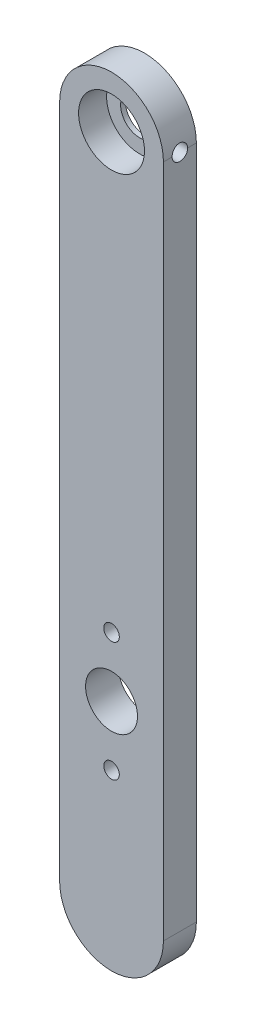
ISO-10303-21;
HEADER;
FILE_DESCRIPTION(('STEP AP214'),'2;1');
FILE_NAME('part.step','',(''),(''),'','','');
FILE_SCHEMA(('AUTOMOTIVE_DESIGN { 1 0 10303 214 1 1 1 1 }'));
ENDSEC;
DATA;
#1=APPLICATION_CONTEXT('core data for automotive mechanical design processes');
#2=APPLICATION_PROTOCOL_DEFINITION('international standard','automotive_design',2000,#1);
#3=PRODUCT_CONTEXT('',#1,'mechanical');
#4=PRODUCT('Part','Part','',(#3));
#5=PRODUCT_RELATED_PRODUCT_CATEGORY('part','',(#4));
#6=PRODUCT_DEFINITION_FORMATION('','',#4);
#7=PRODUCT_DEFINITION_CONTEXT('part definition',#1,'design');
#8=PRODUCT_DEFINITION('design','',#6,#7);
#9=PRODUCT_DEFINITION_SHAPE('','',#8);
#10=(LENGTH_UNIT() NAMED_UNIT(*) SI_UNIT(.MILLI.,.METRE.));
#11=(NAMED_UNIT(*) PLANE_ANGLE_UNIT() SI_UNIT($,.RADIAN.));
#12=(NAMED_UNIT(*) SI_UNIT($,.STERADIAN.) SOLID_ANGLE_UNIT());
#13=UNCERTAINTY_MEASURE_WITH_UNIT(LENGTH_MEASURE(1.E-05),#10,'distance_accuracy_value','');
#14=(GEOMETRIC_REPRESENTATION_CONTEXT(3) GLOBAL_UNCERTAINTY_ASSIGNED_CONTEXT((#13)) GLOBAL_UNIT_ASSIGNED_CONTEXT((#10,
#11,#12)) REPRESENTATION_CONTEXT('',''));
#15=CARTESIAN_POINT('',(0.,0.,0.));
#16=DIRECTION('',(0.,0.,1.));
#17=DIRECTION('',(1.,0.,0.));
#18=AXIS2_PLACEMENT_3D('',#15,#16,#17);
#19=CARTESIAN_POINT('',(0.,65.,6.35));
#20=DIRECTION('',(0.,0.,-1.));
#21=DIRECTION('',(-1.,0.,0.));
#22=AXIS2_PLACEMENT_3D('',#19,#20,#21);
#23=CYLINDRICAL_SURFACE('',#22,10.);
#24=DIRECTION('',(0.,0.,-1.));
#25=VECTOR('',#24,1.);
#26=CARTESIAN_POINT('',(10.,65.,6.35));
#27=LINE('',#26,#25);
#28=CARTESIAN_POINT('',(10.,65.,6.35));
#29=VERTEX_POINT('',#28);
#30=CARTESIAN_POINT('',(10.,65.,4.675));
#31=VERTEX_POINT('',#30);
#32=EDGE_CURVE('E103',#29,#31,#27,.T.);
#33=ORIENTED_EDGE('',*,*,#32,.T.);
#34=CARTESIAN_POINT('',(10.,65.,4.675));
#35=CARTESIAN_POINT('',(10.0000014685064,65.0419508736504,4.67499999537497));
#36=CARTESIAN_POINT('',(9.99973568704626,65.0838814247861,4.67323901308362));
#37=CARTESIAN_POINT('',(9.99868521479133,65.1674379610659,4.66621554686748));
#38=CARTESIAN_POINT('',(9.99790056985298,65.209063972796,4.66095337237313));
#39=CARTESIAN_POINT('',(9.99479588619008,65.3329314886251,4.63997389798776));
#40=CARTESIAN_POINT('',(9.99172497314488,65.414336104094,4.61906345213102));
#41=CARTESIAN_POINT('',(9.98391758917327,65.5724284238681,4.56400833880989));
#42=CARTESIAN_POINT('',(9.97918066213689,65.6491148296921,4.5298600469162));
#43=CARTESIAN_POINT('',(9.96856534959666,65.795678956542,4.44931680441856));
#44=CARTESIAN_POINT('',(9.96268699957249,65.8655568890993,4.40292223445846));
#45=CARTESIAN_POINT('',(9.95039202655103,65.9970445259113,4.29882526877398));
#46=CARTESIAN_POINT('',(9.94397197786064,66.0585940245488,4.24104725672947));
#47=CARTESIAN_POINT('',(9.93134322340571,66.1711695622192,4.11597898804128));
#48=CARTESIAN_POINT('',(9.92513455081534,66.2221939557012,4.04868724673825));
#49=CARTESIAN_POINT('',(9.91359860664949,66.3124986952271,3.90609726537435));
#50=CARTESIAN_POINT('',(9.90827581009234,66.3517201783025,3.83076135392112));
#51=CARTESIAN_POINT('',(9.89916189093435,66.4169278188574,3.67448245934922));
#52=CARTESIAN_POINT('',(9.895370595862,66.4429154667638,3.59354010880838));
#53=CARTESIAN_POINT('',(9.88978259593446,66.4807317658851,3.42898294683243));
#54=CARTESIAN_POINT('',(9.887971200635,66.4926647518175,3.34539262016965));
#55=CARTESIAN_POINT('',(9.88650348181946,66.502356291557,3.177375865936));
#56=CARTESIAN_POINT('',(9.88684708626086,66.5001153192052,3.09294946640958));
#57=CARTESIAN_POINT('',(9.88963718763457,66.4816073070065,2.92639867029686));
#58=CARTESIAN_POINT('',(9.89206620232456,66.4654568683382,2.84426098127216));
#59=CARTESIAN_POINT('',(9.8987261063924,66.4197709914713,2.68387516321023));
#60=CARTESIAN_POINT('',(9.90295703599485,66.3902352544683,2.60562712104614));
#61=CARTESIAN_POINT('',(9.9127634526375,66.3184953494658,2.45488514064789));
#62=CARTESIAN_POINT('',(9.91834418902924,66.2762415606179,2.38241517319383));
#63=CARTESIAN_POINT('',(9.9302173239709,66.1803019201499,2.2455528505844));
#64=CARTESIAN_POINT('',(9.93650974119489,66.1266157685189,2.18116070747983));
#65=CARTESIAN_POINT('',(9.94917383032147,66.008703665483,2.06161087632562));
#66=CARTESIAN_POINT('',(9.95554567106682,65.9443788291936,2.0065507016511));
#67=CARTESIAN_POINT('',(9.96759485035054,65.8073265565302,1.90797639950774));
#68=CARTESIAN_POINT('',(9.97327198853176,65.7345967077954,1.86446559874978));
#69=CARTESIAN_POINT('',(9.98329879009978,65.5827046110578,1.79022045732164));
#70=CARTESIAN_POINT('',(9.98764689268089,65.5035349372274,1.75950112360304));
#71=CARTESIAN_POINT('',(9.99450841265944,65.3411362683109,1.71186541412821));
#72=CARTESIAN_POINT('',(9.99702457329285,65.257913542677,1.69492839559143));
#73=CARTESIAN_POINT('',(9.99899011948561,65.1450605368035,1.68174566903024));
#74=CARTESIAN_POINT('',(9.99936853868559,65.1160817227372,1.679214915476));
#75=CARTESIAN_POINT('',(9.9998732025813,65.0580727726574,1.67584431341621));
#76=CARTESIAN_POINT('',(9.99999987181747,65.029042805815,1.67500161822181));
#77=CARTESIAN_POINT('',(10.,65.,1.675));
#78=B_SPLINE_CURVE_WITH_KNOTS('',3,(#34,#35,#36,#37,#38,#39,#40,#41,#42,#43,#44,#45,#46,#47,#48,
#49,#50,#51,#52,#53,#54,#55,#56,#57,#58,#59,#60,#61,#62,#63,#64,#65,#66,#67,#68,#69,#70,#71,#72,
#73,#74,#75,#76,#77),.UNSPECIFIED.,.F.,.F.,(4,2,2,2,2,2,2,2,2,2,2,2,2,2,2,2,2,2,2,2,2,4),(0.,
0.125774596002484,0.251538077699336,0.502550836025,0.753632368476194,1.00470609762704,
1.25750755614574,1.51034850908069,1.7644302832657,2.01848343580798,2.27063849496753,
2.52278512452481,2.7728383913245,3.02289724042136,3.27394465404091,3.52499865652247,
3.77853286607111,4.03214002520141,4.28604388366316,4.53956674814968,4.62680426579006,
4.71389454454005),.UNSPECIFIED.);
#79=CARTESIAN_POINT('',(10.,65.,1.675));
#80=VERTEX_POINT('',#79);
#81=EDGE_CURVE('E58',#31,#80,#78,.T.);
#82=ORIENTED_EDGE('',*,*,#81,.T.);
#83=CARTESIAN_POINT('',(10.,65.,0.));
#84=VERTEX_POINT('',#83);
#85=EDGE_CURVE('E88',#80,#84,#27,.T.);
#86=ORIENTED_EDGE('',*,*,#85,.T.);
#87=CARTESIAN_POINT('',(0.,65.,0.));
#88=DIRECTION('',(0.,0.,1.));
#89=DIRECTION('',(1.,0.,0.));
#90=AXIS2_PLACEMENT_3D('',#87,#88,#89);
#91=CIRCLE('',#90,10.);
#92=CARTESIAN_POINT('',(-10.,65.,0.));
#93=VERTEX_POINT('',#92);
#94=EDGE_CURVE('E140',#84,#93,#91,.T.);
#95=ORIENTED_EDGE('',*,*,#94,.T.);
#96=DIRECTION('',(0.,0.,-1.));
#97=VECTOR('',#96,1.);
#98=CARTESIAN_POINT('',(-10.,65.,6.35));
#99=LINE('',#98,#97);
#100=CARTESIAN_POINT('',(-10.,65.,6.35));
#101=VERTEX_POINT('',#100);
#102=EDGE_CURVE('E11',#101,#93,#99,.T.);
#103=ORIENTED_EDGE('',*,*,#102,.F.);
#104=CARTESIAN_POINT('',(0.,65.,6.35));
#105=DIRECTION('',(0.,0.,1.));
#106=DIRECTION('',(1.,0.,0.));
#107=AXIS2_PLACEMENT_3D('',#104,#105,#106);
#108=CIRCLE('',#107,10.);
#109=EDGE_CURVE('E142',#29,#101,#108,.T.);
#110=ORIENTED_EDGE('',*,*,#109,.F.);
#111=EDGE_LOOP('',(#33,#82,#86,#95,#103,#110));
#112=FACE_BOUND('',#111,.T.);
#113=ADVANCED_FACE('F37',(#112),#23,.T.);
#114=CARTESIAN_POINT('',(-10.,65.,6.35));
#115=DIRECTION('',(1.,0.,0.));
#116=DIRECTION('',(0.,0.,-1.));
#117=AXIS2_PLACEMENT_3D('',#114,#115,#116);
#118=PLANE('',#117);
#119=DIRECTION('',(0.,-1.,0.));
#120=VECTOR('',#119,1.);
#121=CARTESIAN_POINT('',(-10.,65.,0.));
#122=LINE('',#121,#120);
#123=CARTESIAN_POINT('',(-10.,-65.,0.));
#124=VERTEX_POINT('',#123);
#125=EDGE_CURVE('E147',#93,#124,#122,.T.);
#126=ORIENTED_EDGE('',*,*,#125,.T.);
#127=DIRECTION('',(0.,0.,-1.));
#128=VECTOR('',#127,1.);
#129=CARTESIAN_POINT('',(-10.,-65.,6.35));
#130=LINE('',#129,#128);
#131=CARTESIAN_POINT('',(-10.,-65.,6.35));
#132=VERTEX_POINT('',#131);
#133=EDGE_CURVE('E51',#132,#124,#130,.T.);
#134=ORIENTED_EDGE('',*,*,#133,.F.);
#135=DIRECTION('',(0.,-1.,0.));
#136=VECTOR('',#135,1.);
#137=CARTESIAN_POINT('',(-10.,65.,6.35));
#138=LINE('',#137,#136);
#139=EDGE_CURVE('E95',#101,#132,#138,.T.);
#140=ORIENTED_EDGE('',*,*,#139,.F.);
#141=ORIENTED_EDGE('',*,*,#102,.T.);
#142=EDGE_LOOP('',(#126,#134,#140,#141));
#143=FACE_BOUND('',#142,.T.);
#144=ADVANCED_FACE('F157',(#143),#118,.F.);
#145=CARTESIAN_POINT('',(0.,-65.,6.35));
#146=DIRECTION('',(0.,0.,-1.));
#147=DIRECTION('',(-1.,0.,0.));
#148=AXIS2_PLACEMENT_3D('',#145,#146,#147);
#149=CYLINDRICAL_SURFACE('',#148,10.);
#150=CARTESIAN_POINT('',(0.,-65.,0.));
#151=DIRECTION('',(0.,0.,1.));
#152=DIRECTION('',(1.,0.,0.));
#153=AXIS2_PLACEMENT_3D('',#150,#151,#152);
#154=CIRCLE('',#153,10.);
#155=CARTESIAN_POINT('',(10.,-65.,0.));
#156=VERTEX_POINT('',#155);
#157=EDGE_CURVE('E148',#124,#156,#154,.T.);
#158=ORIENTED_EDGE('',*,*,#157,.T.);
#159=DIRECTION('',(0.,0.,-1.));
#160=VECTOR('',#159,1.);
#161=CARTESIAN_POINT('',(10.,-65.,6.35));
#162=LINE('',#161,#160);
#163=CARTESIAN_POINT('',(10.,-65.,6.35));
#164=VERTEX_POINT('',#163);
#165=EDGE_CURVE('E112',#164,#156,#162,.T.);
#166=ORIENTED_EDGE('',*,*,#165,.F.);
#167=CARTESIAN_POINT('',(0.,-65.,6.35));
#168=DIRECTION('',(0.,0.,1.));
#169=DIRECTION('',(1.,0.,0.));
#170=AXIS2_PLACEMENT_3D('',#167,#168,#169);
#171=CIRCLE('',#170,10.);
#172=EDGE_CURVE('E113',#132,#164,#171,.T.);
#173=ORIENTED_EDGE('',*,*,#172,.F.);
#174=ORIENTED_EDGE('',*,*,#133,.T.);
#175=EDGE_LOOP('',(#158,#166,#173,#174));
#176=FACE_BOUND('',#175,.T.);
#177=ADVANCED_FACE('F152',(#176),#149,.T.);
#178=CARTESIAN_POINT('',(10.,65.,6.35));
#179=DIRECTION('',(-1.,0.,0.));
#180=DIRECTION('',(0.,0.,1.));
#181=AXIS2_PLACEMENT_3D('',#178,#179,#180);
#182=PLANE('',#181);
#183=ORIENTED_EDGE('',*,*,#85,.F.);
#184=CARTESIAN_POINT('',(10.,65.,3.175));
#185=DIRECTION('',(1.,0.,0.));
#186=DIRECTION('',(0.,0.,-1.));
#187=AXIS2_PLACEMENT_3D('',#184,#185,#186);
#188=CIRCLE('',#187,1.5);
#189=EDGE_CURVE('E97',#31,#80,#188,.T.);
#190=ORIENTED_EDGE('',*,*,#189,.F.);
#191=ORIENTED_EDGE('',*,*,#32,.F.);
#192=DIRECTION('',(0.,1.,0.));
#193=VECTOR('',#192,1.);
#194=CARTESIAN_POINT('',(10.,65.,6.35));
#195=LINE('',#194,#193);
#196=EDGE_CURVE('E67',#164,#29,#195,.T.);
#197=ORIENTED_EDGE('',*,*,#196,.F.);
#198=ORIENTED_EDGE('',*,*,#165,.T.);
#199=DIRECTION('',(0.,1.,0.));
#200=VECTOR('',#199,1.);
#201=CARTESIAN_POINT('',(10.,65.,0.));
#202=LINE('',#201,#200);
#203=EDGE_CURVE('E109',#156,#84,#202,.T.);
#204=ORIENTED_EDGE('',*,*,#203,.T.);
#205=EDGE_LOOP('',(#183,#190,#191,#197,#198,#204));
#206=FACE_BOUND('',#205,.T.);
#207=ADVANCED_FACE('F106',(#206),#182,.F.);
#208=CARTESIAN_POINT('',(0.,65.,6.35));
#209=DIRECTION('',(0.,0.,1.));
#210=DIRECTION('',(1.,0.,0.));
#211=AXIS2_PLACEMENT_3D('',#208,#209,#210);
#212=PLANE('',#211);
#213=CARTESIAN_POINT('',(0.,-41.5,6.35));
#214=DIRECTION('',(0.,0.,1.));
#215=DIRECTION('',(1.,0.,0.));
#216=AXIS2_PLACEMENT_3D('',#213,#214,#215);
#217=CIRCLE('',#216,1.5);
#218=CARTESIAN_POINT('',(1.5,-41.5,6.35));
#219=VERTEX_POINT('',#218);
#220=EDGE_CURVE('E104',#219,#219,#217,.T.);
#221=ORIENTED_EDGE('',*,*,#220,.F.);
#222=EDGE_LOOP('',(#221));
#223=FACE_BOUND('',#222,.T.);
#224=CARTESIAN_POINT('',(0.,-18.5,6.35));
#225=DIRECTION('',(0.,0.,1.));
#226=DIRECTION('',(1.,0.,0.));
#227=AXIS2_PLACEMENT_3D('',#224,#225,#226);
#228=CIRCLE('',#227,1.5);
#229=CARTESIAN_POINT('',(1.5,-18.5,6.35));
#230=VERTEX_POINT('',#229);
#231=EDGE_CURVE('E272',#230,#230,#228,.T.);
#232=ORIENTED_EDGE('',*,*,#231,.F.);
#233=EDGE_LOOP('',(#232));
#234=FACE_BOUND('',#233,.T.);
#235=CARTESIAN_POINT('',(0.,-30.,6.35));
#236=DIRECTION('',(0.,0.,1.));
#237=DIRECTION('',(1.,0.,0.));
#238=AXIS2_PLACEMENT_3D('',#235,#236,#237);
#239=CIRCLE('',#238,5.);
#240=CARTESIAN_POINT('',(5.,-30.,6.35));
#241=VERTEX_POINT('',#240);
#242=EDGE_CURVE('E135',#241,#241,#239,.T.);
#243=ORIENTED_EDGE('',*,*,#242,.F.);
#244=EDGE_LOOP('',(#243));
#245=FACE_BOUND('',#244,.T.);
#246=CARTESIAN_POINT('',(0.,65.,6.35));
#247=DIRECTION('',(0.,0.,1.));
#248=DIRECTION('',(1.,0.,0.));
#249=AXIS2_PLACEMENT_3D('',#246,#247,#248);
#250=CIRCLE('',#249,6.35);
#251=CARTESIAN_POINT('',(6.34999999999999,65.,6.35));
#252=VERTEX_POINT('',#251);
#253=EDGE_CURVE('E122',#252,#252,#250,.T.);
#254=ORIENTED_EDGE('',*,*,#253,.F.);
#255=EDGE_LOOP('',(#254));
#256=FACE_BOUND('',#255,.T.);
#257=ORIENTED_EDGE('',*,*,#109,.T.);
#258=ORIENTED_EDGE('',*,*,#139,.T.);
#259=ORIENTED_EDGE('',*,*,#172,.T.);
#260=ORIENTED_EDGE('',*,*,#196,.T.);
#261=EDGE_LOOP('',(#257,#258,#259,#260));
#262=FACE_BOUND('',#261,.T.);
#263=ADVANCED_FACE('F158',(#223,#234,#245,#256,#262),#212,.T.);
#264=CARTESIAN_POINT('',(0.,65.,0.));
#265=DIRECTION('',(0.,0.,1.));
#266=DIRECTION('',(1.,0.,0.));
#267=AXIS2_PLACEMENT_3D('',#264,#265,#266);
#268=PLANE('',#267);
#269=CARTESIAN_POINT('',(0.,-41.5,0.));
#270=DIRECTION('',(0.,0.,1.));
#271=DIRECTION('',(1.,0.,0.));
#272=AXIS2_PLACEMENT_3D('',#269,#270,#271);
#273=CIRCLE('',#272,1.5);
#274=CARTESIAN_POINT('',(1.5,-41.5,0.));
#275=VERTEX_POINT('',#274);
#276=EDGE_CURVE('E275',#275,#275,#273,.T.);
#277=ORIENTED_EDGE('',*,*,#276,.T.);
#278=EDGE_LOOP('',(#277));
#279=FACE_BOUND('',#278,.T.);
#280=CARTESIAN_POINT('',(0.,-18.5,0.));
#281=DIRECTION('',(0.,0.,1.));
#282=DIRECTION('',(1.,0.,0.));
#283=AXIS2_PLACEMENT_3D('',#280,#281,#282);
#284=CIRCLE('',#283,1.5);
#285=CARTESIAN_POINT('',(1.5,-18.5,0.));
#286=VERTEX_POINT('',#285);
#287=EDGE_CURVE('E269',#286,#286,#284,.T.);
#288=ORIENTED_EDGE('',*,*,#287,.T.);
#289=EDGE_LOOP('',(#288));
#290=FACE_BOUND('',#289,.T.);
#291=CARTESIAN_POINT('',(0.,-30.,0.));
#292=DIRECTION('',(0.,0.,1.));
#293=DIRECTION('',(1.,0.,0.));
#294=AXIS2_PLACEMENT_3D('',#291,#292,#293);
#295=CIRCLE('',#294,5.);
#296=CARTESIAN_POINT('',(5.,-30.,0.));
#297=VERTEX_POINT('',#296);
#298=EDGE_CURVE('E130',#297,#297,#295,.T.);
#299=ORIENTED_EDGE('',*,*,#298,.T.);
#300=EDGE_LOOP('',(#299));
#301=FACE_BOUND('',#300,.T.);
#302=CARTESIAN_POINT('',(0.,65.,0.));
#303=DIRECTION('',(0.,0.,1.));
#304=DIRECTION('',(1.,0.,0.));
#305=AXIS2_PLACEMENT_3D('',#302,#303,#304);
#306=CIRCLE('',#305,3.65);
#307=CARTESIAN_POINT('',(3.64999999999999,65.,0.));
#308=VERTEX_POINT('',#307);
#309=EDGE_CURVE('E120',#308,#308,#306,.T.);
#310=ORIENTED_EDGE('',*,*,#309,.T.);
#311=EDGE_LOOP('',(#310));
#312=FACE_BOUND('',#311,.T.);
#313=ORIENTED_EDGE('',*,*,#94,.F.);
#314=ORIENTED_EDGE('',*,*,#203,.F.);
#315=ORIENTED_EDGE('',*,*,#157,.F.);
#316=ORIENTED_EDGE('',*,*,#125,.F.);
#317=EDGE_LOOP('',(#313,#314,#315,#316));
#318=FACE_BOUND('',#317,.T.);
#319=ADVANCED_FACE('F155',(#279,#290,#301,#312,#318),#268,.F.);
#320=CARTESIAN_POINT('',(0.,65.,0.95));
#321=DIRECTION('',(0.,0.,1.));
#322=DIRECTION('',(1.,0.,0.));
#323=AXIS2_PLACEMENT_3D('',#320,#321,#322);
#324=CYLINDRICAL_SURFACE('',#323,6.35);
#325=CARTESIAN_POINT('',(6.34999999999999,65.,1.675));
#326=CARTESIAN_POINT('',(6.34999851724394,65.0830209487421,1.67500257688155));
#327=CARTESIAN_POINT('',(6.34835548464634,65.1660717055425,1.68191570943469));
#328=CARTESIAN_POINT('',(6.34196006203194,65.3298026167738,1.70934998922864));
#329=CARTESIAN_POINT('',(6.3372057005927,65.4104812342622,1.72987976445553));
#330=CARTESIAN_POINT('',(6.32511541536285,65.567078972002,1.78385930734223));
#331=CARTESIAN_POINT('',(6.31778241043487,65.6430033597441,1.8172944710726));
#332=CARTESIAN_POINT('',(6.3013205537597,65.7881641285173,1.89608655368896));
#333=CARTESIAN_POINT('',(6.29219168938456,65.8574004625148,1.94144355640646));
#334=CARTESIAN_POINT('',(6.27294410619426,65.9885041460754,2.04368053942395));
#335=CARTESIAN_POINT('',(6.26281145281054,66.0502298306783,2.10073957298258));
#336=CARTESIAN_POINT('',(6.24279339171245,66.1633300796207,2.22437709118982));
#337=CARTESIAN_POINT('',(6.23290800919792,66.2147035926849,2.2909565414756));
#338=CARTESIAN_POINT('',(6.21436474587977,66.3062885785891,2.43282095444812));
#339=CARTESIAN_POINT('',(6.20572463411778,66.3463450769597,2.50820849776784));
#340=CARTESIAN_POINT('',(6.19085199880807,66.4131635374986,2.66488360121361));
#341=CARTESIAN_POINT('',(6.1846191352844,66.4399273771435,2.74617032626985));
#342=CARTESIAN_POINT('',(6.17540936388889,66.4789243640839,2.91078791256924));
#343=CARTESIAN_POINT('',(6.17237584620283,66.4914104910839,2.99405560628803));
#344=CARTESIAN_POINT('',(6.16973853210433,66.5022850018873,3.16155484676637));
#345=CARTESIAN_POINT('',(6.17013424074104,66.5006754201675,3.24578625267775));
#346=CARTESIAN_POINT('',(6.1742596142321,66.4836068356708,3.41090996101587));
#347=CARTESIAN_POINT('',(6.17791755158492,66.4684457767716,3.4918351294975));
#348=CARTESIAN_POINT('',(6.18804133190496,66.4251784049009,3.64995972740286));
#349=CARTESIAN_POINT('',(6.19450735566557,66.3970712584127,3.72715891658072));
#350=CARTESIAN_POINT('',(6.20958678218058,66.3284467845848,3.87645664379615));
#351=CARTESIAN_POINT('',(6.218219265795,66.2878184115154,3.94850213199463));
#352=CARTESIAN_POINT('',(6.23664776102025,66.1953826164008,4.08486136281564));
#353=CARTESIAN_POINT('',(6.24644395581354,66.1435734333074,4.14917388495947));
#354=CARTESIAN_POINT('',(6.26640074159938,66.0286879051709,4.26995273495692));
#355=CARTESIAN_POINT('',(6.27656427474605,65.9653592290764,4.3261788302287));
#356=CARTESIAN_POINT('',(6.29588562944103,65.8300525364603,4.42725550259074));
#357=CARTESIAN_POINT('',(6.30504342639665,65.7580743085263,4.47210580155035));
#358=CARTESIAN_POINT('',(6.32135942493141,65.6071916141095,4.54923262841604));
#359=CARTESIAN_POINT('',(6.32851195395596,65.5282683124554,4.58147358631544));
#360=CARTESIAN_POINT('',(6.33996993682453,65.3659165605986,4.63216630266991));
#361=CARTESIAN_POINT('',(6.3442758753518,65.2824888799654,4.65062040865422));
#362=CARTESIAN_POINT('',(6.34948503249581,65.1155535389803,4.67285668601183));
#363=CARTESIAN_POINT('',(6.35046421324578,65.0320918238016,4.6769664522477));
#364=CARTESIAN_POINT('',(6.3491242902122,64.8656739204676,4.67129106790021));
#365=CARTESIAN_POINT('',(6.34680544961473,64.7827176925044,4.66150702605959));
#366=CARTESIAN_POINT('',(6.33917838174838,64.6207798301404,4.62859261840112));
#367=CARTESIAN_POINT('',(6.33390950352624,64.5417604890031,4.60563783257741));
#368=CARTESIAN_POINT('',(6.3209740002995,64.3886959136126,4.54723149966576));
#369=CARTESIAN_POINT('',(6.31330714919517,64.3146511492018,4.51177877413378));
#370=CARTESIAN_POINT('',(6.29624149651371,64.172310695681,4.42872644839968));
#371=CARTESIAN_POINT('',(6.28681663475877,64.104127654475,4.38093926429422));
#372=CARTESIAN_POINT('',(6.2673266811016,63.9766314517236,4.27481752950993));
#373=CARTESIAN_POINT('',(6.25726149136241,63.9173196502941,4.21648136451075));
#374=CARTESIAN_POINT('',(6.23735679650374,63.8079241957992,4.08940401687872));
#375=CARTESIAN_POINT('',(6.22752694929492,63.7580690961075,4.02046426640513));
#376=CARTESIAN_POINT('',(6.20945265145425,63.6706397078834,3.87500057804812));
#377=CARTESIAN_POINT('',(6.20120812992859,63.6330648701401,3.79847697953709));
#378=CARTESIAN_POINT('',(6.1873240848113,63.5715336346671,3.64043566793411));
#379=CARTESIAN_POINT('',(6.18166930794985,63.547497298881,3.55895048593829));
#380=CARTESIAN_POINT('',(6.17358371023305,63.5135023808069,3.39294412141734));
#381=CARTESIAN_POINT('',(6.17115227288945,63.5035411065321,3.30842352261579));
#382=CARTESIAN_POINT('',(6.16983199335336,63.4981081090918,3.14106112146151));
#383=CARTESIAN_POINT('',(6.1708541839276,63.5022725122384,3.05823163293271));
#384=CARTESIAN_POINT('',(6.17612233302334,63.5241486824006,2.89449127444565));
#385=CARTESIAN_POINT('',(6.18036823966432,63.5418602313968,2.81358037363241));
#386=CARTESIAN_POINT('',(6.19155859321835,63.5901393302196,2.65632098353121));
#387=CARTESIAN_POINT('',(6.19849016148399,63.620645581895,2.57995269713613));
#388=CARTESIAN_POINT('',(6.21427398682872,63.6935982482732,2.43336716284175));
#389=CARTESIAN_POINT('',(6.2231264810561,63.7360461374252,2.36315067591788));
#390=CARTESIAN_POINT('',(6.24201391004486,63.8328479374515,2.22908721321493));
#391=CARTESIAN_POINT('',(6.25207168946106,63.8874575011935,2.1654280187217));
#392=CARTESIAN_POINT('',(6.27209257501467,64.0065250551108,2.0480583428238));
#393=CARTESIAN_POINT('',(6.2820556584478,64.0709853468298,1.99435019290582));
#394=CARTESIAN_POINT('',(6.30095070373691,64.2091449224679,1.8975916638141));
#395=CARTESIAN_POINT('',(6.30986403352164,64.2829733035021,1.85472173683658));
#396=CARTESIAN_POINT('',(6.32546353967865,64.436988746183,1.78206930320467));
#397=CARTESIAN_POINT('',(6.3321514369973,64.5171708347603,1.752276678042));
#398=CARTESIAN_POINT('',(6.34146337323501,64.6644312976428,1.71145636515545));
#399=CARTESIAN_POINT('',(6.34464362420469,64.7307618976541,1.69781315294047));
#400=CARTESIAN_POINT('',(6.34891247920238,64.8647217864704,1.67958419109222));
#401=CARTESIAN_POINT('',(6.35000120821273,64.9323509974308,1.67499790024723));
#402=CARTESIAN_POINT('',(6.34999999999999,65.,1.675));
#403=B_SPLINE_CURVE_WITH_KNOTS('',3,(#325,#326,#327,#328,#329,#330,#331,#332,#333,#334,#335,
#336,#337,#338,#339,#340,#341,#342,#343,#344,#345,#346,#347,#348,#349,#350,#351,#352,#353,#354,
#355,#356,#357,#358,#359,#360,#361,#362,#363,#364,#365,#366,#367,#368,#369,#370,#371,#372,#373,
#374,#375,#376,#377,#378,#379,#380,#381,#382,#383,#384,#385,#386,#387,#388,#389,#390,#391,#392,
#393,#394,#395,#396,#397,#398,#399,#400,#401,#402),.UNSPECIFIED.,.T.,.F.,(4,2,2,2,2,2,2,2,2,2,2,
2,2,2,2,2,2,2,2,2,2,2,2,2,2,2,2,2,2,2,2,2,2,2,2,2,2,2,4),(0.,0.248815070913735,
0.497787950658731,0.746479911109808,0.995173620349719,1.24800235932539,1.50085676043726,
1.75702225097102,2.01315154998108,2.26466865776918,2.51614946391933,2.76223359968086,
3.00833358145963,3.25668218758359,3.50506993876883,3.75975438391662,4.01444505532946,
4.26984909538289,4.52520963709548,4.77469868586514,5.02416782622498,5.2703860856486,
5.51662756746638,5.76686059612937,6.01713195064179,6.2728421065447,6.52854082474266,
6.78271350366646,7.0368375631117,7.28446569177386,7.53208983534432,7.7785409483085,
8.02502250427132,8.27727905299751,8.52959462980921,8.78586924469398,9.04194521710613,
9.24470244341198,9.44744755324906),.UNSPECIFIED.);
#404=CARTESIAN_POINT('',(6.34999999999999,65.,1.675));
#405=VERTEX_POINT('',#404);
#406=EDGE_CURVE('E41',#405,#405,#403,.T.);
#407=ORIENTED_EDGE('',*,*,#406,.T.);
#408=EDGE_LOOP('',(#407));
#409=FACE_BOUND('',#408,.T.);
#410=CARTESIAN_POINT('',(0.,65.,0.95));
#411=DIRECTION('',(0.,0.,1.));
#412=DIRECTION('',(1.,0.,0.));
#413=AXIS2_PLACEMENT_3D('',#410,#411,#412);
#414=CIRCLE('',#413,6.35);
#415=CARTESIAN_POINT('',(6.34999999999999,65.,0.95));
#416=VERTEX_POINT('',#415);
#417=EDGE_CURVE('E127',#416,#416,#414,.T.);
#418=ORIENTED_EDGE('',*,*,#417,.F.);
#419=EDGE_LOOP('',(#418));
#420=FACE_BOUND('',#419,.T.);
#421=ORIENTED_EDGE('',*,*,#253,.T.);
#422=EDGE_LOOP('',(#421));
#423=FACE_BOUND('',#422,.T.);
#424=ADVANCED_FACE('F166',(#409,#420,#423),#324,.F.);
#425=CARTESIAN_POINT('',(0.,65.,0.95));
#426=DIRECTION('',(0.,0.,1.));
#427=DIRECTION('',(1.,0.,0.));
#428=AXIS2_PLACEMENT_3D('',#425,#426,#427);
#429=PLANE('',#428);
#430=CARTESIAN_POINT('',(0.,65.,0.95));
#431=DIRECTION('',(0.,0.,1.));
#432=DIRECTION('',(1.,0.,0.));
#433=AXIS2_PLACEMENT_3D('',#430,#431,#432);
#434=CIRCLE('',#433,3.65);
#435=CARTESIAN_POINT('',(3.64999999999999,65.,0.95));
#436=VERTEX_POINT('',#435);
#437=EDGE_CURVE('E123',#436,#436,#434,.T.);
#438=ORIENTED_EDGE('',*,*,#437,.F.);
#439=EDGE_LOOP('',(#438));
#440=FACE_BOUND('',#439,.T.);
#441=ORIENTED_EDGE('',*,*,#417,.T.);
#442=EDGE_LOOP('',(#441));
#443=FACE_BOUND('',#442,.T.);
#444=ADVANCED_FACE('F200',(#440,#443),#429,.T.);
#445=CARTESIAN_POINT('',(0.,65.,-4.45));
#446=DIRECTION('',(0.,0.,1.));
#447=DIRECTION('',(1.,0.,0.));
#448=AXIS2_PLACEMENT_3D('',#445,#446,#447);
#449=CYLINDRICAL_SURFACE('',#448,3.65);
#450=ORIENTED_EDGE('',*,*,#437,.T.);
#451=EDGE_LOOP('',(#450));
#452=FACE_BOUND('',#451,.T.);
#453=ORIENTED_EDGE('',*,*,#309,.F.);
#454=EDGE_LOOP('',(#453));
#455=FACE_BOUND('',#454,.T.);
#456=ADVANCED_FACE('F235',(#452,#455),#449,.F.);
#457=CARTESIAN_POINT('',(0.,-30.,0.));
#458=DIRECTION('',(0.,0.,1.));
#459=DIRECTION('',(1.,0.,0.));
#460=AXIS2_PLACEMENT_3D('',#457,#458,#459);
#461=CYLINDRICAL_SURFACE('',#460,5.);
#462=ORIENTED_EDGE('',*,*,#298,.F.);
#463=EDGE_LOOP('',(#462));
#464=FACE_BOUND('',#463,.T.);
#465=ORIENTED_EDGE('',*,*,#242,.T.);
#466=EDGE_LOOP('',(#465));
#467=FACE_BOUND('',#466,.T.);
#468=ADVANCED_FACE('F227',(#464,#467),#461,.F.);
#469=CARTESIAN_POINT('',(0.,-18.5,0.));
#470=DIRECTION('',(0.,0.,1.));
#471=DIRECTION('',(1.,0.,0.));
#472=AXIS2_PLACEMENT_3D('',#469,#470,#471);
#473=CYLINDRICAL_SURFACE('',#472,1.5);
#474=ORIENTED_EDGE('',*,*,#287,.F.);
#475=EDGE_LOOP('',(#474));
#476=FACE_BOUND('',#475,.T.);
#477=ORIENTED_EDGE('',*,*,#231,.T.);
#478=EDGE_LOOP('',(#477));
#479=FACE_BOUND('',#478,.T.);
#480=ADVANCED_FACE('F220',(#476,#479),#473,.F.);
#481=CARTESIAN_POINT('',(0.,-41.5,0.));
#482=DIRECTION('',(0.,0.,1.));
#483=DIRECTION('',(1.,0.,0.));
#484=AXIS2_PLACEMENT_3D('',#481,#482,#483);
#485=CYLINDRICAL_SURFACE('',#484,1.5);
#486=ORIENTED_EDGE('',*,*,#276,.F.);
#487=EDGE_LOOP('',(#486));
#488=FACE_BOUND('',#487,.T.);
#489=ORIENTED_EDGE('',*,*,#220,.T.);
#490=EDGE_LOOP('',(#489));
#491=FACE_BOUND('',#490,.T.);
#492=ADVANCED_FACE('F211',(#488,#491),#485,.F.);
#493=CARTESIAN_POINT('',(0.,65.,3.175));
#494=DIRECTION('',(1.,0.,0.));
#495=DIRECTION('',(0.,0.,-1.));
#496=AXIS2_PLACEMENT_3D('',#493,#494,#495);
#497=CYLINDRICAL_SURFACE('',#496,1.5);
#498=ORIENTED_EDGE('',*,*,#406,.F.);
#499=EDGE_LOOP('',(#498));
#500=FACE_BOUND('',#499,.T.);
#501=ORIENTED_EDGE('',*,*,#189,.T.);
#502=ORIENTED_EDGE('',*,*,#81,.F.);
#503=EDGE_LOOP('',(#501,#502));
#504=FACE_BOUND('',#503,.T.);
#505=ADVANCED_FACE('F98',(#500,#504),#497,.F.);
#506=CLOSED_SHELL('',(#113,#144,#177,#207,#263,#319,#424,#444,#456,#468,#480,#492,#505));
#507=MANIFOLD_SOLID_BREP('B2',#506);
#508=ADVANCED_BREP_SHAPE_REPRESENTATION('',(#18,#507),#14);
#509=SHAPE_DEFINITION_REPRESENTATION(#9,#508);
ENDSEC;
END-ISO-10303-21;
